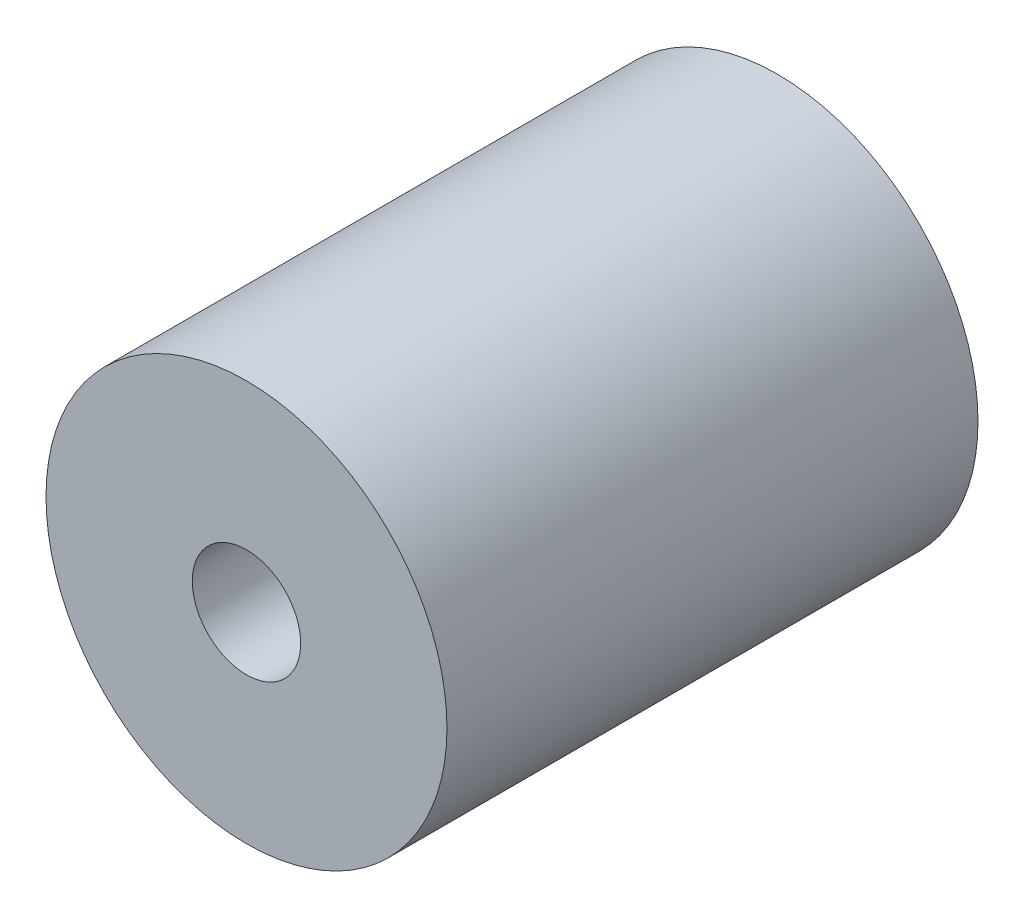
ISO-10303-21;
HEADER;
FILE_DESCRIPTION(('STEP AP214'),'2;1');
FILE_NAME('part.step','',(''),(''),'','','');
FILE_SCHEMA(('AUTOMOTIVE_DESIGN { 1 0 10303 214 1 1 1 1 }'));
ENDSEC;
DATA;
#1=APPLICATION_CONTEXT('core data for automotive mechanical design processes');
#2=APPLICATION_PROTOCOL_DEFINITION('international standard','automotive_design',2000,#1);
#3=PRODUCT_CONTEXT('',#1,'mechanical');
#4=PRODUCT('Part','Part','',(#3));
#5=PRODUCT_RELATED_PRODUCT_CATEGORY('part','',(#4));
#6=PRODUCT_DEFINITION_FORMATION('','',#4);
#7=PRODUCT_DEFINITION_CONTEXT('part definition',#1,'design');
#8=PRODUCT_DEFINITION('design','',#6,#7);
#9=PRODUCT_DEFINITION_SHAPE('','',#8);
#10=(LENGTH_UNIT() NAMED_UNIT(*) SI_UNIT(.MILLI.,.METRE.));
#11=(NAMED_UNIT(*) PLANE_ANGLE_UNIT() SI_UNIT($,.RADIAN.));
#12=(NAMED_UNIT(*) SI_UNIT($,.STERADIAN.) SOLID_ANGLE_UNIT());
#13=UNCERTAINTY_MEASURE_WITH_UNIT(LENGTH_MEASURE(1.E-05),#10,'distance_accuracy_value','');
#14=(GEOMETRIC_REPRESENTATION_CONTEXT(3) GLOBAL_UNCERTAINTY_ASSIGNED_CONTEXT((#13)) GLOBAL_UNIT_ASSIGNED_CONTEXT((#10,
#11,#12)) REPRESENTATION_CONTEXT('',''));
#15=CARTESIAN_POINT('',(0.,0.,0.));
#16=DIRECTION('',(0.,0.,1.));
#17=DIRECTION('',(1.,0.,0.));
#18=AXIS2_PLACEMENT_3D('',#15,#16,#17);
#19=CARTESIAN_POINT('',(0.,0.,24.892));
#20=DIRECTION('',(0.,0.,-1.));
#21=DIRECTION('',(-1.,0.,0.));
#22=AXIS2_PLACEMENT_3D('',#19,#20,#21);
#23=CYLINDRICAL_SURFACE('',#22,2.54);
#24=CARTESIAN_POINT('',(0.,0.,24.892));
#25=DIRECTION('',(0.,0.,-1.));
#26=DIRECTION('',(-1.,0.,0.));
#27=AXIS2_PLACEMENT_3D('',#24,#25,#26);
#28=CIRCLE('',#27,2.54);
#29=CARTESIAN_POINT('',(-2.54,0.,24.892));
#30=VERTEX_POINT('',#29);
#31=EDGE_CURVE('E50',#30,#30,#28,.T.);
#32=ORIENTED_EDGE('',*,*,#31,.F.);
#33=EDGE_LOOP('',(#32));
#34=FACE_BOUND('',#33,.T.);
#35=CARTESIAN_POINT('',(0.,0.,12.446));
#36=DIRECTION('',(0.,0.,-1.));
#37=DIRECTION('',(-1.,0.,0.));
#38=AXIS2_PLACEMENT_3D('',#35,#36,#37);
#39=CIRCLE('',#38,2.54);
#40=CARTESIAN_POINT('',(-2.54,0.,12.446));
#41=VERTEX_POINT('',#40);
#42=EDGE_CURVE('E39',#41,#41,#39,.F.);
#43=ORIENTED_EDGE('',*,*,#42,.F.);
#44=EDGE_LOOP('',(#43));
#45=FACE_BOUND('',#44,.T.);
#46=ADVANCED_FACE('F35',(#34,#45),#23,.F.);
#47=CARTESIAN_POINT('',(0.,0.,24.892));
#48=DIRECTION('',(0.,0.,-1.));
#49=DIRECTION('',(-1.,0.,0.));
#50=AXIS2_PLACEMENT_3D('',#47,#48,#49);
#51=CYLINDRICAL_SURFACE('',#50,9.398);
#52=CARTESIAN_POINT('',(0.,0.,24.892));
#53=DIRECTION('',(0.,0.,1.));
#54=DIRECTION('',(1.,0.,0.));
#55=AXIS2_PLACEMENT_3D('',#52,#53,#54);
#56=CIRCLE('',#55,9.398);
#57=CARTESIAN_POINT('',(9.398,0.,24.892));
#58=VERTEX_POINT('',#57);
#59=EDGE_CURVE('E10',#58,#58,#56,.T.);
#60=ORIENTED_EDGE('',*,*,#59,.F.);
#61=EDGE_LOOP('',(#60));
#62=FACE_BOUND('',#61,.T.);
#63=CARTESIAN_POINT('',(0.,0.,0.));
#64=DIRECTION('',(0.,0.,1.));
#65=DIRECTION('',(1.,0.,0.));
#66=AXIS2_PLACEMENT_3D('',#63,#64,#65);
#67=CIRCLE('',#66,9.398);
#68=CARTESIAN_POINT('',(9.398,0.,0.));
#69=VERTEX_POINT('',#68);
#70=EDGE_CURVE('E44',#69,#69,#67,.T.);
#71=ORIENTED_EDGE('',*,*,#70,.T.);
#72=EDGE_LOOP('',(#71));
#73=FACE_BOUND('',#72,.T.);
#74=ADVANCED_FACE('F37',(#62,#73),#51,.T.);
#75=CARTESIAN_POINT('',(0.,0.,24.892));
#76=DIRECTION('',(0.,0.,1.));
#77=DIRECTION('',(1.,0.,0.));
#78=AXIS2_PLACEMENT_3D('',#75,#76,#77);
#79=PLANE('',#78);
#80=ORIENTED_EDGE('',*,*,#31,.T.);
#81=EDGE_LOOP('',(#80));
#82=FACE_BOUND('',#81,.T.);
#83=ORIENTED_EDGE('',*,*,#59,.T.);
#84=EDGE_LOOP('',(#83));
#85=FACE_BOUND('',#84,.T.);
#86=ADVANCED_FACE('F76',(#82,#85),#79,.T.);
#87=CARTESIAN_POINT('',(0.,0.,0.));
#88=DIRECTION('',(0.,0.,1.));
#89=DIRECTION('',(1.,0.,0.));
#90=AXIS2_PLACEMENT_3D('',#87,#88,#89);
#91=PLANE('',#90);
#92=CARTESIAN_POINT('',(0.,0.,0.));
#93=DIRECTION('',(0.,0.,-1.));
#94=DIRECTION('',(-1.,0.,0.));
#95=AXIS2_PLACEMENT_3D('',#92,#93,#94);
#96=CIRCLE('',#95,3.9878);
#97=CARTESIAN_POINT('',(-3.9878,0.,0.));
#98=VERTEX_POINT('',#97);
#99=EDGE_CURVE('E55',#98,#98,#96,.T.);
#100=ORIENTED_EDGE('',*,*,#99,.F.);
#101=EDGE_LOOP('',(#100));
#102=FACE_BOUND('',#101,.T.);
#103=ORIENTED_EDGE('',*,*,#70,.F.);
#104=EDGE_LOOP('',(#103));
#105=FACE_BOUND('',#104,.T.);
#106=ADVANCED_FACE('F84',(#102,#105),#91,.F.);
#107=CARTESIAN_POINT('',(0.,0.,12.446));
#108=DIRECTION('',(0.,0.,-1.));
#109=DIRECTION('',(-1.,0.,0.));
#110=AXIS2_PLACEMENT_3D('',#107,#108,#109);
#111=PLANE('',#110);
#112=CARTESIAN_POINT('',(0.,0.,12.446));
#113=DIRECTION('',(0.,0.,-1.));
#114=DIRECTION('',(-1.,0.,0.));
#115=AXIS2_PLACEMENT_3D('',#112,#113,#114);
#116=CIRCLE('',#115,3.9878);
#117=CARTESIAN_POINT('',(-3.9878,0.,12.446));
#118=VERTEX_POINT('',#117);
#119=EDGE_CURVE('E59',#118,#118,#116,.T.);
#120=ORIENTED_EDGE('',*,*,#119,.T.);
#121=EDGE_LOOP('',(#120));
#122=FACE_BOUND('',#121,.T.);
#123=ORIENTED_EDGE('',*,*,#42,.T.);
#124=EDGE_LOOP('',(#123));
#125=FACE_BOUND('',#124,.T.);
#126=ADVANCED_FACE('F68',(#122,#125),#111,.T.);
#127=CARTESIAN_POINT('',(0.,0.,12.446));
#128=DIRECTION('',(0.,0.,-1.));
#129=DIRECTION('',(-1.,0.,0.));
#130=AXIS2_PLACEMENT_3D('',#127,#128,#129);
#131=CYLINDRICAL_SURFACE('',#130,3.9878);
#132=ORIENTED_EDGE('',*,*,#119,.F.);
#133=EDGE_LOOP('',(#132));
#134=FACE_BOUND('',#133,.T.);
#135=ORIENTED_EDGE('',*,*,#99,.T.);
#136=EDGE_LOOP('',(#135));
#137=FACE_BOUND('',#136,.T.);
#138=ADVANCED_FACE('F81',(#134,#137),#131,.F.);
#139=CLOSED_SHELL('',(#46,#74,#86,#106,#126,#138));
#140=MANIFOLD_SOLID_BREP('B2',#139);
#141=ADVANCED_BREP_SHAPE_REPRESENTATION('',(#18,#140),#14);
#142=SHAPE_DEFINITION_REPRESENTATION(#9,#141);
ENDSEC;
END-ISO-10303-21;
